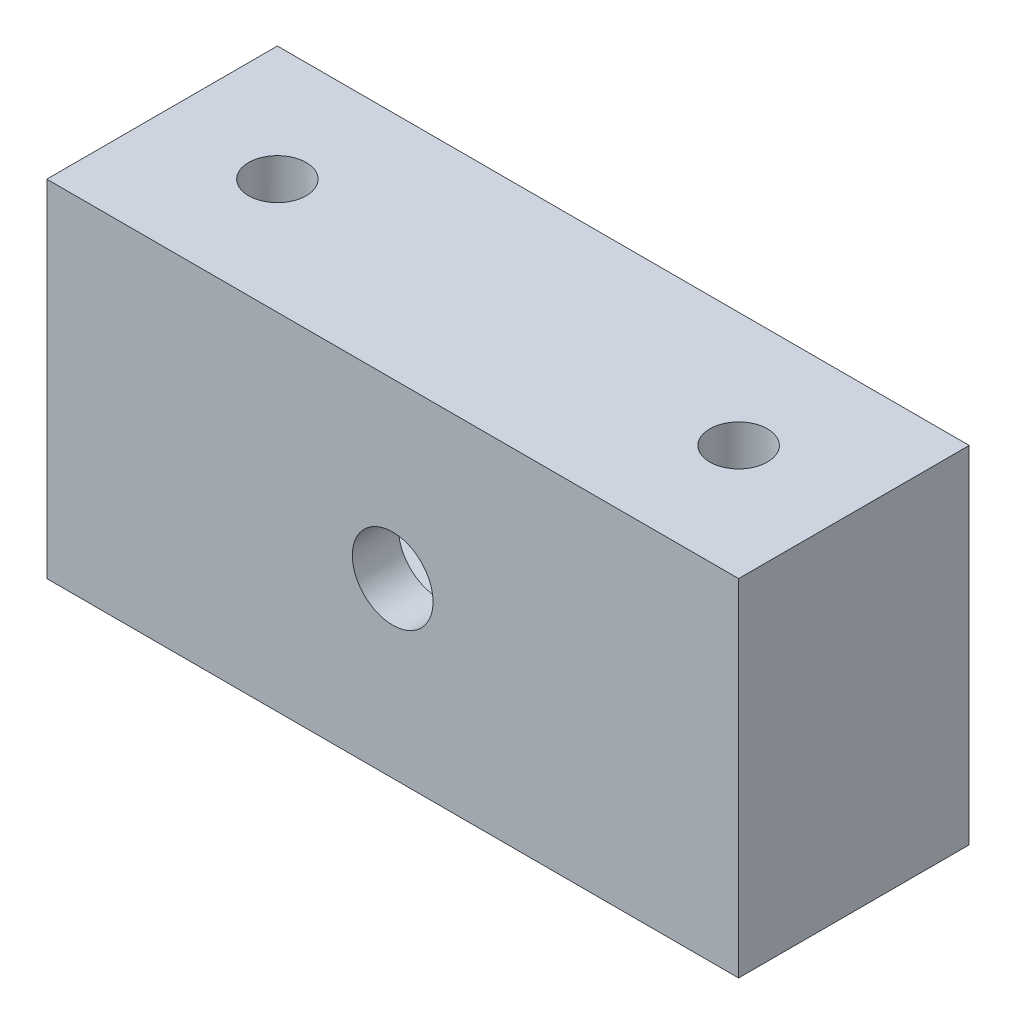
ISO-10303-21;
HEADER;
FILE_DESCRIPTION(('STEP AP214'),'2;1');
FILE_NAME('part.step','',(''),(''),'','','');
FILE_SCHEMA(('AUTOMOTIVE_DESIGN { 1 0 10303 214 1 1 1 1 }'));
ENDSEC;
DATA;
#1=APPLICATION_CONTEXT('core data for automotive mechanical design processes');
#2=APPLICATION_PROTOCOL_DEFINITION('international standard','automotive_design',2000,#1);
#3=PRODUCT_CONTEXT('',#1,'mechanical');
#4=PRODUCT('Part','Part','',(#3));
#5=PRODUCT_RELATED_PRODUCT_CATEGORY('part','',(#4));
#6=PRODUCT_DEFINITION_FORMATION('','',#4);
#7=PRODUCT_DEFINITION_CONTEXT('part definition',#1,'design');
#8=PRODUCT_DEFINITION('design','',#6,#7);
#9=PRODUCT_DEFINITION_SHAPE('','',#8);
#10=(LENGTH_UNIT() NAMED_UNIT(*) SI_UNIT(.MILLI.,.METRE.));
#11=(NAMED_UNIT(*) PLANE_ANGLE_UNIT() SI_UNIT($,.RADIAN.));
#12=(NAMED_UNIT(*) SI_UNIT($,.STERADIAN.) SOLID_ANGLE_UNIT());
#13=UNCERTAINTY_MEASURE_WITH_UNIT(LENGTH_MEASURE(1.E-05),#10,'distance_accuracy_value','');
#14=(GEOMETRIC_REPRESENTATION_CONTEXT(3) GLOBAL_UNCERTAINTY_ASSIGNED_CONTEXT((#13)) GLOBAL_UNIT_ASSIGNED_CONTEXT((#10,
#11,#12)) REPRESENTATION_CONTEXT('',''));
#15=CARTESIAN_POINT('',(0.,0.,0.));
#16=DIRECTION('',(0.,0.,1.));
#17=DIRECTION('',(1.,0.,0.));
#18=AXIS2_PLACEMENT_3D('',#15,#16,#17);
#19=CARTESIAN_POINT('',(15.,7.5,10.));
#20=DIRECTION('',(-1.,0.,0.));
#21=DIRECTION('',(0.,-1.,0.));
#22=AXIS2_PLACEMENT_3D('',#19,#20,#21);
#23=PLANE('',#22);
#24=DIRECTION('',(0.,1.,0.));
#25=VECTOR('',#24,1.);
#26=CARTESIAN_POINT('',(15.,7.5,0.));
#27=LINE('',#26,#25);
#28=CARTESIAN_POINT('',(15.,-7.5,0.));
#29=VERTEX_POINT('',#28);
#30=CARTESIAN_POINT('',(15.,7.5,0.));
#31=VERTEX_POINT('',#30);
#32=EDGE_CURVE('E254',#29,#31,#27,.T.);
#33=ORIENTED_EDGE('',*,*,#32,.T.);
#34=DIRECTION('',(0.,0.,-1.));
#35=VECTOR('',#34,1.);
#36=CARTESIAN_POINT('',(15.,7.5,10.));
#37=LINE('',#36,#35);
#38=CARTESIAN_POINT('',(15.,7.5,10.));
#39=VERTEX_POINT('',#38);
#40=EDGE_CURVE('E290',#39,#31,#37,.T.);
#41=ORIENTED_EDGE('',*,*,#40,.F.);
#42=DIRECTION('',(0.,1.,0.));
#43=VECTOR('',#42,1.);
#44=CARTESIAN_POINT('',(15.,7.5,10.));
#45=LINE('',#44,#43);
#46=CARTESIAN_POINT('',(15.,-7.5,10.));
#47=VERTEX_POINT('',#46);
#48=EDGE_CURVE('E264',#47,#39,#45,.T.);
#49=ORIENTED_EDGE('',*,*,#48,.F.);
#50=DIRECTION('',(0.,0.,-1.));
#51=VECTOR('',#50,1.);
#52=CARTESIAN_POINT('',(15.,-7.5,10.));
#53=LINE('',#52,#51);
#54=EDGE_CURVE('E274',#47,#29,#53,.T.);
#55=ORIENTED_EDGE('',*,*,#54,.T.);
#56=EDGE_LOOP('',(#33,#41,#49,#55));
#57=FACE_BOUND('',#56,.T.);
#58=ADVANCED_FACE('F35',(#57),#23,.F.);
#59=CARTESIAN_POINT('',(-15.,7.5,10.));
#60=DIRECTION('',(0.,-1.,0.));
#61=DIRECTION('',(0.,0.,-1.));
#62=AXIS2_PLACEMENT_3D('',#59,#60,#61);
#63=PLANE('',#62);
#64=CARTESIAN_POINT('',(-10.,7.5,5.));
#65=DIRECTION('',(0.,-1.,0.));
#66=DIRECTION('',(0.,0.,-1.));
#67=AXIS2_PLACEMENT_3D('',#64,#65,#66);
#68=CIRCLE('',#67,1.25);
#69=CARTESIAN_POINT('',(-10.,7.5,3.75));
#70=VERTEX_POINT('',#69);
#71=EDGE_CURVE('E163',#70,#70,#68,.T.);
#72=ORIENTED_EDGE('',*,*,#71,.T.);
#73=EDGE_LOOP('',(#72));
#74=FACE_BOUND('',#73,.T.);
#75=CARTESIAN_POINT('',(10.,7.5,5.));
#76=DIRECTION('',(0.,-1.,0.));
#77=DIRECTION('',(0.,0.,-1.));
#78=AXIS2_PLACEMENT_3D('',#75,#76,#77);
#79=CIRCLE('',#78,1.25);
#80=CARTESIAN_POINT('',(10.,7.5,3.75));
#81=VERTEX_POINT('',#80);
#82=EDGE_CURVE('E533',#81,#81,#79,.T.);
#83=ORIENTED_EDGE('',*,*,#82,.T.);
#84=EDGE_LOOP('',(#83));
#85=FACE_BOUND('',#84,.T.);
#86=DIRECTION('',(-1.,0.,0.));
#87=VECTOR('',#86,1.);
#88=CARTESIAN_POINT('',(-15.,7.5,0.));
#89=LINE('',#88,#87);
#90=CARTESIAN_POINT('',(-15.,7.5,0.));
#91=VERTEX_POINT('',#90);
#92=EDGE_CURVE('E277',#31,#91,#89,.T.);
#93=ORIENTED_EDGE('',*,*,#92,.T.);
#94=DIRECTION('',(0.,0.,-1.));
#95=VECTOR('',#94,1.);
#96=CARTESIAN_POINT('',(-15.,7.5,10.));
#97=LINE('',#96,#95);
#98=CARTESIAN_POINT('',(-15.,7.5,10.));
#99=VERTEX_POINT('',#98);
#100=EDGE_CURVE('E287',#99,#91,#97,.T.);
#101=ORIENTED_EDGE('',*,*,#100,.F.);
#102=DIRECTION('',(-1.,0.,0.));
#103=VECTOR('',#102,1.);
#104=CARTESIAN_POINT('',(-15.,7.5,10.));
#105=LINE('',#104,#103);
#106=EDGE_CURVE('E267',#39,#99,#105,.T.);
#107=ORIENTED_EDGE('',*,*,#106,.F.);
#108=ORIENTED_EDGE('',*,*,#40,.T.);
#109=EDGE_LOOP('',(#93,#101,#107,#108));
#110=FACE_BOUND('',#109,.T.);
#111=ADVANCED_FACE('F347',(#74,#85,#110),#63,.F.);
#112=CARTESIAN_POINT('',(-15.,7.5,10.));
#113=DIRECTION('',(1.,0.,0.));
#114=DIRECTION('',(0.,1.,0.));
#115=AXIS2_PLACEMENT_3D('',#112,#113,#114);
#116=PLANE('',#115);
#117=DIRECTION('',(0.,-1.,0.));
#118=VECTOR('',#117,1.);
#119=CARTESIAN_POINT('',(-15.,7.5,0.));
#120=LINE('',#119,#118);
#121=CARTESIAN_POINT('',(-15.,-7.5,0.));
#122=VERTEX_POINT('',#121);
#123=EDGE_CURVE('E279',#91,#122,#120,.T.);
#124=ORIENTED_EDGE('',*,*,#123,.T.);
#125=DIRECTION('',(0.,0.,-1.));
#126=VECTOR('',#125,1.);
#127=CARTESIAN_POINT('',(-15.,-7.5,10.));
#128=LINE('',#127,#126);
#129=CARTESIAN_POINT('',(-15.,-7.5,10.));
#130=VERTEX_POINT('',#129);
#131=EDGE_CURVE('E284',#130,#122,#128,.T.);
#132=ORIENTED_EDGE('',*,*,#131,.F.);
#133=DIRECTION('',(0.,-1.,0.));
#134=VECTOR('',#133,1.);
#135=CARTESIAN_POINT('',(-15.,7.5,10.));
#136=LINE('',#135,#134);
#137=EDGE_CURVE('E270',#99,#130,#136,.T.);
#138=ORIENTED_EDGE('',*,*,#137,.F.);
#139=ORIENTED_EDGE('',*,*,#100,.T.);
#140=EDGE_LOOP('',(#124,#132,#138,#139));
#141=FACE_BOUND('',#140,.T.);
#142=ADVANCED_FACE('F353',(#141),#116,.F.);
#143=CARTESIAN_POINT('',(-15.,-7.5,10.));
#144=DIRECTION('',(0.,1.,0.));
#145=DIRECTION('',(0.,0.,1.));
#146=AXIS2_PLACEMENT_3D('',#143,#144,#145);
#147=PLANE('',#146);
#148=CARTESIAN_POINT('',(-10.,-7.5,5.));
#149=DIRECTION('',(0.,-1.,0.));
#150=DIRECTION('',(0.,0.,-1.));
#151=AXIS2_PLACEMENT_3D('',#148,#149,#150);
#152=CIRCLE('',#151,1.25);
#153=CARTESIAN_POINT('',(-10.,-7.5,3.75));
#154=VERTEX_POINT('',#153);
#155=EDGE_CURVE('E541',#154,#154,#152,.T.);
#156=ORIENTED_EDGE('',*,*,#155,.F.);
#157=EDGE_LOOP('',(#156));
#158=FACE_BOUND('',#157,.T.);
#159=CARTESIAN_POINT('',(10.,-7.5,5.));
#160=DIRECTION('',(0.,-1.,0.));
#161=DIRECTION('',(0.,0.,-1.));
#162=AXIS2_PLACEMENT_3D('',#159,#160,#161);
#163=CIRCLE('',#162,1.25);
#164=CARTESIAN_POINT('',(10.,-7.5,3.75));
#165=VERTEX_POINT('',#164);
#166=EDGE_CURVE('E333',#165,#165,#163,.T.);
#167=ORIENTED_EDGE('',*,*,#166,.F.);
#168=EDGE_LOOP('',(#167));
#169=FACE_BOUND('',#168,.T.);
#170=DIRECTION('',(1.,0.,0.));
#171=VECTOR('',#170,1.);
#172=CARTESIAN_POINT('',(-15.,-7.5,0.));
#173=LINE('',#172,#171);
#174=EDGE_CURVE('E268',#122,#29,#173,.T.);
#175=ORIENTED_EDGE('',*,*,#174,.T.);
#176=ORIENTED_EDGE('',*,*,#54,.F.);
#177=DIRECTION('',(1.,0.,0.));
#178=VECTOR('',#177,1.);
#179=CARTESIAN_POINT('',(-15.,-7.5,10.));
#180=LINE('',#179,#178);
#181=EDGE_CURVE('E272',#130,#47,#180,.T.);
#182=ORIENTED_EDGE('',*,*,#181,.F.);
#183=ORIENTED_EDGE('',*,*,#131,.T.);
#184=EDGE_LOOP('',(#175,#176,#182,#183));
#185=FACE_BOUND('',#184,.T.);
#186=ADVANCED_FACE('F378',(#158,#169,#185),#147,.F.);
#187=CARTESIAN_POINT('',(0.,0.,10.));
#188=DIRECTION('',(0.,0.,1.));
#189=DIRECTION('',(1.,0.,0.));
#190=AXIS2_PLACEMENT_3D('',#187,#188,#189);
#191=PLANE('',#190);
#192=CARTESIAN_POINT('',(0.,0.,10.));
#193=DIRECTION('',(0.,0.,-1.));
#194=DIRECTION('',(-1.,0.,0.));
#195=AXIS2_PLACEMENT_3D('',#192,#193,#194);
#196=CIRCLE('',#195,1.75);
#197=CARTESIAN_POINT('',(-1.75,0.,10.));
#198=VERTEX_POINT('',#197);
#199=EDGE_CURVE('E236',#198,#198,#196,.T.);
#200=ORIENTED_EDGE('',*,*,#199,.T.);
#201=EDGE_LOOP('',(#200));
#202=FACE_BOUND('',#201,.T.);
#203=ORIENTED_EDGE('',*,*,#48,.T.);
#204=ORIENTED_EDGE('',*,*,#106,.T.);
#205=ORIENTED_EDGE('',*,*,#137,.T.);
#206=ORIENTED_EDGE('',*,*,#181,.T.);
#207=EDGE_LOOP('',(#203,#204,#205,#206));
#208=FACE_BOUND('',#207,.T.);
#209=ADVANCED_FACE('F375',(#202,#208),#191,.T.);
#210=CARTESIAN_POINT('',(0.,0.,0.));
#211=DIRECTION('',(0.,0.,1.));
#212=DIRECTION('',(1.,0.,0.));
#213=AXIS2_PLACEMENT_3D('',#210,#211,#212);
#214=PLANE('',#213);
#215=DIRECTION('',(-1.,0.,0.));
#216=VECTOR('',#215,1.);
#217=CARTESIAN_POINT('',(12.,-4.5,0.));
#218=LINE('',#217,#216);
#219=CARTESIAN_POINT('',(10.,-4.5,0.));
#220=VERTEX_POINT('',#219);
#221=CARTESIAN_POINT('',(-10.,-4.5,0.));
#222=VERTEX_POINT('',#221);
#223=EDGE_CURVE('E257',#220,#222,#218,.T.);
#224=ORIENTED_EDGE('',*,*,#223,.F.);
#225=CARTESIAN_POINT('',(10.,-2.5,0.));
#226=DIRECTION('',(0.,0.,1.));
#227=DIRECTION('',(1.,0.,0.));
#228=AXIS2_PLACEMENT_3D('',#225,#226,#227);
#229=CIRCLE('',#228,2.);
#230=CARTESIAN_POINT('',(12.,-2.5,0.));
#231=VERTEX_POINT('',#230);
#232=EDGE_CURVE('E198',#220,#231,#229,.T.);
#233=ORIENTED_EDGE('',*,*,#232,.T.);
#234=DIRECTION('',(0.,-1.,0.));
#235=VECTOR('',#234,1.);
#236=CARTESIAN_POINT('',(12.,4.5,0.));
#237=LINE('',#236,#235);
#238=CARTESIAN_POINT('',(12.,2.5,0.));
#239=VERTEX_POINT('',#238);
#240=EDGE_CURVE('E239',#239,#231,#237,.T.);
#241=ORIENTED_EDGE('',*,*,#240,.F.);
#242=CARTESIAN_POINT('',(10.,2.5,0.));
#243=DIRECTION('',(0.,0.,1.));
#244=DIRECTION('',(1.,0.,0.));
#245=AXIS2_PLACEMENT_3D('',#242,#243,#244);
#246=CIRCLE('',#245,2.);
#247=CARTESIAN_POINT('',(10.,4.5,0.));
#248=VERTEX_POINT('',#247);
#249=EDGE_CURVE('E202',#239,#248,#246,.T.);
#250=ORIENTED_EDGE('',*,*,#249,.T.);
#251=DIRECTION('',(1.,0.,0.));
#252=VECTOR('',#251,1.);
#253=CARTESIAN_POINT('',(-12.,4.5,0.));
#254=LINE('',#253,#252);
#255=CARTESIAN_POINT('',(-10.,4.5,0.));
#256=VERTEX_POINT('',#255);
#257=EDGE_CURVE('E246',#256,#248,#254,.T.);
#258=ORIENTED_EDGE('',*,*,#257,.F.);
#259=CARTESIAN_POINT('',(-10.,2.5,0.));
#260=DIRECTION('',(0.,0.,1.));
#261=DIRECTION('',(1.,0.,0.));
#262=AXIS2_PLACEMENT_3D('',#259,#260,#261);
#263=CIRCLE('',#262,2.);
#264=CARTESIAN_POINT('',(-12.,2.5,0.));
#265=VERTEX_POINT('',#264);
#266=EDGE_CURVE('E200',#256,#265,#263,.T.);
#267=ORIENTED_EDGE('',*,*,#266,.T.);
#268=DIRECTION('',(0.,1.,0.));
#269=VECTOR('',#268,1.);
#270=CARTESIAN_POINT('',(-12.,-4.5,0.));
#271=LINE('',#270,#269);
#272=CARTESIAN_POINT('',(-12.,-2.5,0.));
#273=VERTEX_POINT('',#272);
#274=EDGE_CURVE('E259',#273,#265,#271,.T.);
#275=ORIENTED_EDGE('',*,*,#274,.F.);
#276=CARTESIAN_POINT('',(-10.,-2.5,0.));
#277=DIRECTION('',(0.,0.,1.));
#278=DIRECTION('',(1.,0.,0.));
#279=AXIS2_PLACEMENT_3D('',#276,#277,#278);
#280=CIRCLE('',#279,2.);
#281=EDGE_CURVE('E196',#273,#222,#280,.T.);
#282=ORIENTED_EDGE('',*,*,#281,.T.);
#283=EDGE_LOOP('',(#224,#233,#241,#250,#258,#267,#275,#282));
#284=FACE_BOUND('',#283,.T.);
#285=ORIENTED_EDGE('',*,*,#32,.F.);
#286=ORIENTED_EDGE('',*,*,#174,.F.);
#287=ORIENTED_EDGE('',*,*,#123,.F.);
#288=ORIENTED_EDGE('',*,*,#92,.F.);
#289=EDGE_LOOP('',(#285,#286,#287,#288));
#290=FACE_BOUND('',#289,.T.);
#291=ADVANCED_FACE('F308',(#284,#290),#214,.F.);
#292=CARTESIAN_POINT('',(12.,4.5,8.));
#293=DIRECTION('',(1.,0.,0.));
#294=DIRECTION('',(0.,1.,0.));
#295=AXIS2_PLACEMENT_3D('',#292,#293,#294);
#296=PLANE('',#295);
#297=ORIENTED_EDGE('',*,*,#240,.T.);
#298=DIRECTION('',(0.,0.,-1.));
#299=VECTOR('',#298,1.);
#300=CARTESIAN_POINT('',(12.,-2.5,8.));
#301=LINE('',#300,#299);
#302=CARTESIAN_POINT('',(12.,-2.5,8.));
#303=VERTEX_POINT('',#302);
#304=EDGE_CURVE('E186',#231,#303,#301,.F.);
#305=ORIENTED_EDGE('',*,*,#304,.T.);
#306=DIRECTION('',(0.,-1.,0.));
#307=VECTOR('',#306,1.);
#308=CARTESIAN_POINT('',(12.,4.5,8.));
#309=LINE('',#308,#307);
#310=CARTESIAN_POINT('',(12.,2.5,8.));
#311=VERTEX_POINT('',#310);
#312=EDGE_CURVE('E242',#311,#303,#309,.T.);
#313=ORIENTED_EDGE('',*,*,#312,.F.);
#314=DIRECTION('',(0.,0.,-1.));
#315=VECTOR('',#314,1.);
#316=CARTESIAN_POINT('',(12.,2.5,0.));
#317=LINE('',#316,#315);
#318=EDGE_CURVE('E183',#311,#239,#317,.T.);
#319=ORIENTED_EDGE('',*,*,#318,.T.);
#320=EDGE_LOOP('',(#297,#305,#313,#319));
#321=FACE_BOUND('',#320,.T.);
#322=ADVANCED_FACE('F331',(#321),#296,.F.);
#323=CARTESIAN_POINT('',(-12.,4.5,8.));
#324=DIRECTION('',(0.,1.,0.));
#325=DIRECTION('',(0.,0.,1.));
#326=AXIS2_PLACEMENT_3D('',#323,#324,#325);
#327=PLANE('',#326);
#328=DIRECTION('',(0.,0.,-1.));
#329=VECTOR('',#328,1.);
#330=CARTESIAN_POINT('',(-10.,4.5,0.));
#331=LINE('',#330,#329);
#332=CARTESIAN_POINT('',(-10.,4.5,8.));
#333=VERTEX_POINT('',#332);
#334=CARTESIAN_POINT('',(-10.,4.5,6.25));
#335=VERTEX_POINT('',#334);
#336=EDGE_CURVE('E193',#333,#335,#331,.T.);
#337=ORIENTED_EDGE('',*,*,#336,.T.);
#338=CARTESIAN_POINT('',(-10.,4.5,5.));
#339=DIRECTION('',(0.,1.,0.));
#340=DIRECTION('',(0.,0.,1.));
#341=AXIS2_PLACEMENT_3D('',#338,#339,#340);
#342=CIRCLE('',#341,1.25);
#343=CARTESIAN_POINT('',(-10.,4.5,3.75));
#344=VERTEX_POINT('',#343);
#345=EDGE_CURVE('E55',#335,#344,#342,.T.);
#346=ORIENTED_EDGE('',*,*,#345,.T.);
#347=EDGE_CURVE('E192',#344,#256,#331,.T.);
#348=ORIENTED_EDGE('',*,*,#347,.T.);
#349=ORIENTED_EDGE('',*,*,#257,.T.);
#350=DIRECTION('',(0.,0.,-1.));
#351=VECTOR('',#350,1.);
#352=CARTESIAN_POINT('',(10.,4.5,8.));
#353=LINE('',#352,#351);
#354=CARTESIAN_POINT('',(10.,4.5,3.75));
#355=VERTEX_POINT('',#354);
#356=EDGE_CURVE('E189',#248,#355,#353,.F.);
#357=ORIENTED_EDGE('',*,*,#356,.T.);
#358=CARTESIAN_POINT('',(10.,4.5,5.));
#359=DIRECTION('',(0.,1.,0.));
#360=DIRECTION('',(0.,0.,1.));
#361=AXIS2_PLACEMENT_3D('',#358,#359,#360);
#362=CIRCLE('',#361,1.25);
#363=CARTESIAN_POINT('',(10.,4.5,6.25));
#364=VERTEX_POINT('',#363);
#365=EDGE_CURVE('E230',#355,#364,#362,.T.);
#366=ORIENTED_EDGE('',*,*,#365,.T.);
#367=CARTESIAN_POINT('',(10.,4.5,8.));
#368=VERTEX_POINT('',#367);
#369=EDGE_CURVE('E188',#364,#368,#353,.F.);
#370=ORIENTED_EDGE('',*,*,#369,.T.);
#371=DIRECTION('',(1.,0.,0.));
#372=VECTOR('',#371,1.);
#373=CARTESIAN_POINT('',(-12.,4.5,8.));
#374=LINE('',#373,#372);
#375=EDGE_CURVE('E251',#333,#368,#374,.T.);
#376=ORIENTED_EDGE('',*,*,#375,.F.);
#377=EDGE_LOOP('',(#337,#346,#348,#349,#357,#366,#370,#376));
#378=FACE_BOUND('',#377,.T.);
#379=ADVANCED_FACE('F324',(#378),#327,.F.);
#380=CARTESIAN_POINT('',(-12.,-4.5,8.));
#381=DIRECTION('',(-1.,0.,0.));
#382=DIRECTION('',(0.,-1.,0.));
#383=AXIS2_PLACEMENT_3D('',#380,#381,#382);
#384=PLANE('',#383);
#385=DIRECTION('',(0.,1.,0.));
#386=VECTOR('',#385,1.);
#387=CARTESIAN_POINT('',(-12.,-4.5,8.));
#388=LINE('',#387,#386);
#389=CARTESIAN_POINT('',(-12.,-2.5,8.));
#390=VERTEX_POINT('',#389);
#391=CARTESIAN_POINT('',(-12.,2.5,8.));
#392=VERTEX_POINT('',#391);
#393=EDGE_CURVE('E248',#390,#392,#388,.T.);
#394=ORIENTED_EDGE('',*,*,#393,.F.);
#395=DIRECTION('',(0.,0.,-1.));
#396=VECTOR('',#395,1.);
#397=CARTESIAN_POINT('',(-12.,-2.5,0.));
#398=LINE('',#397,#396);
#399=EDGE_CURVE('E294',#390,#273,#398,.T.);
#400=ORIENTED_EDGE('',*,*,#399,.T.);
#401=ORIENTED_EDGE('',*,*,#274,.T.);
#402=DIRECTION('',(0.,0.,-1.));
#403=VECTOR('',#402,1.);
#404=CARTESIAN_POINT('',(-12.,2.5,8.));
#405=LINE('',#404,#403);
#406=EDGE_CURVE('E293',#265,#392,#405,.F.);
#407=ORIENTED_EDGE('',*,*,#406,.T.);
#408=EDGE_LOOP('',(#394,#400,#401,#407));
#409=FACE_BOUND('',#408,.T.);
#410=ADVANCED_FACE('F313',(#409),#384,.F.);
#411=CARTESIAN_POINT('',(12.,-4.5,8.));
#412=DIRECTION('',(0.,-1.,0.));
#413=DIRECTION('',(0.,0.,-1.));
#414=AXIS2_PLACEMENT_3D('',#411,#412,#413);
#415=PLANE('',#414);
#416=DIRECTION('',(0.,0.,-1.));
#417=VECTOR('',#416,1.);
#418=CARTESIAN_POINT('',(-10.,-4.5,8.));
#419=LINE('',#418,#417);
#420=CARTESIAN_POINT('',(-10.,-4.5,3.75));
#421=VERTEX_POINT('',#420);
#422=EDGE_CURVE('E161',#222,#421,#419,.F.);
#423=ORIENTED_EDGE('',*,*,#422,.T.);
#424=CARTESIAN_POINT('',(-10.,-4.5,5.));
#425=DIRECTION('',(0.,-1.,0.));
#426=DIRECTION('',(0.,0.,-1.));
#427=AXIS2_PLACEMENT_3D('',#424,#425,#426);
#428=CIRCLE('',#427,1.25);
#429=CARTESIAN_POINT('',(-10.,-4.5,6.25));
#430=VERTEX_POINT('',#429);
#431=EDGE_CURVE('E62',#421,#430,#428,.T.);
#432=ORIENTED_EDGE('',*,*,#431,.T.);
#433=CARTESIAN_POINT('',(-10.,-4.5,8.));
#434=VERTEX_POINT('',#433);
#435=EDGE_CURVE('E158',#430,#434,#419,.F.);
#436=ORIENTED_EDGE('',*,*,#435,.T.);
#437=DIRECTION('',(-1.,0.,0.));
#438=VECTOR('',#437,1.);
#439=CARTESIAN_POINT('',(12.,-4.5,8.));
#440=LINE('',#439,#438);
#441=CARTESIAN_POINT('',(10.,-4.5,8.));
#442=VERTEX_POINT('',#441);
#443=EDGE_CURVE('E245',#442,#434,#440,.T.);
#444=ORIENTED_EDGE('',*,*,#443,.F.);
#445=DIRECTION('',(0.,0.,-1.));
#446=VECTOR('',#445,1.);
#447=CARTESIAN_POINT('',(10.,-4.5,0.));
#448=LINE('',#447,#446);
#449=CARTESIAN_POINT('',(10.,-4.5,6.25));
#450=VERTEX_POINT('',#449);
#451=EDGE_CURVE('E169',#442,#450,#448,.T.);
#452=ORIENTED_EDGE('',*,*,#451,.T.);
#453=CARTESIAN_POINT('',(10.,-4.5,5.));
#454=DIRECTION('',(0.,-1.,0.));
#455=DIRECTION('',(0.,0.,-1.));
#456=AXIS2_PLACEMENT_3D('',#453,#454,#455);
#457=CIRCLE('',#456,1.25);
#458=CARTESIAN_POINT('',(10.,-4.5,3.75));
#459=VERTEX_POINT('',#458);
#460=EDGE_CURVE('E231',#450,#459,#457,.T.);
#461=ORIENTED_EDGE('',*,*,#460,.T.);
#462=EDGE_CURVE('E173',#459,#220,#448,.T.);
#463=ORIENTED_EDGE('',*,*,#462,.T.);
#464=ORIENTED_EDGE('',*,*,#223,.T.);
#465=EDGE_LOOP('',(#423,#432,#436,#444,#452,#461,#463,#464));
#466=FACE_BOUND('',#465,.T.);
#467=ADVANCED_FACE('F156',(#466),#415,.F.);
#468=CARTESIAN_POINT('',(0.,0.,8.));
#469=DIRECTION('',(0.,0.,-1.));
#470=DIRECTION('',(-1.,0.,0.));
#471=AXIS2_PLACEMENT_3D('',#468,#469,#470);
#472=PLANE('',#471);
#473=CARTESIAN_POINT('',(0.,0.,8.));
#474=DIRECTION('',(0.,0.,-1.));
#475=DIRECTION('',(-1.,0.,0.));
#476=AXIS2_PLACEMENT_3D('',#473,#474,#475);
#477=CIRCLE('',#476,1.75);
#478=CARTESIAN_POINT('',(-1.75,0.,8.));
#479=VERTEX_POINT('',#478);
#480=EDGE_CURVE('E235',#479,#479,#477,.T.);
#481=ORIENTED_EDGE('',*,*,#480,.F.);
#482=EDGE_LOOP('',(#481));
#483=FACE_BOUND('',#482,.T.);
#484=ORIENTED_EDGE('',*,*,#443,.T.);
#485=CARTESIAN_POINT('',(-10.,-2.5,8.));
#486=DIRECTION('',(0.,0.,-1.));
#487=DIRECTION('',(-1.,0.,0.));
#488=AXIS2_PLACEMENT_3D('',#485,#486,#487);
#489=CIRCLE('',#488,2.);
#490=EDGE_CURVE('E168',#434,#390,#489,.T.);
#491=ORIENTED_EDGE('',*,*,#490,.T.);
#492=ORIENTED_EDGE('',*,*,#393,.T.);
#493=CARTESIAN_POINT('',(-10.,2.5,8.));
#494=DIRECTION('',(0.,0.,-1.));
#495=DIRECTION('',(-1.,0.,0.));
#496=AXIS2_PLACEMENT_3D('',#493,#494,#495);
#497=CIRCLE('',#496,2.);
#498=EDGE_CURVE('E178',#392,#333,#497,.T.);
#499=ORIENTED_EDGE('',*,*,#498,.T.);
#500=ORIENTED_EDGE('',*,*,#375,.T.);
#501=CARTESIAN_POINT('',(10.,2.5,8.));
#502=DIRECTION('',(0.,0.,-1.));
#503=DIRECTION('',(-1.,0.,0.));
#504=AXIS2_PLACEMENT_3D('',#501,#502,#503);
#505=CIRCLE('',#504,2.);
#506=EDGE_CURVE('E171',#368,#311,#505,.T.);
#507=ORIENTED_EDGE('',*,*,#506,.T.);
#508=ORIENTED_EDGE('',*,*,#312,.T.);
#509=CARTESIAN_POINT('',(10.,-2.5,8.));
#510=DIRECTION('',(0.,0.,-1.));
#511=DIRECTION('',(-1.,0.,0.));
#512=AXIS2_PLACEMENT_3D('',#509,#510,#511);
#513=CIRCLE('',#512,2.);
#514=EDGE_CURVE('E180',#303,#442,#513,.T.);
#515=ORIENTED_EDGE('',*,*,#514,.T.);
#516=EDGE_LOOP('',(#484,#491,#492,#499,#500,#507,#508,#515));
#517=FACE_BOUND('',#516,.T.);
#518=ADVANCED_FACE('F321',(#483,#517),#472,.T.);
#519=CARTESIAN_POINT('',(-10.,-2.5,8.));
#520=DIRECTION('',(0.,0.,1.));
#521=DIRECTION('',(1.,0.,0.));
#522=AXIS2_PLACEMENT_3D('',#519,#520,#521);
#523=CYLINDRICAL_SURFACE('',#522,2.);
#524=ORIENTED_EDGE('',*,*,#435,.F.);
#525=CARTESIAN_POINT('',(-10.,-4.5,6.25));
#526=CARTESIAN_POINT('',(-10.031922119046,-4.5000037585437,6.25000245376051));
#527=CARTESIAN_POINT('',(-10.0638265161901,-4.4992349396388,6.24877628678655));
#528=CARTESIAN_POINT('',(-10.1273610628371,-4.49619336183597,6.24390245511982));
#529=CARTESIAN_POINT('',(-10.1589913484681,-4.4939213986083,6.24025607153456));
#530=CARTESIAN_POINT('',(-10.2527484927996,-4.48495105118465,6.2258022366321));
#531=CARTESIAN_POINT('',(-10.314169763864,-4.47609705197088,6.21147899680838));
#532=CARTESIAN_POINT('',(-10.4331791135223,-4.45346648902098,6.1742011222019));
#533=CARTESIAN_POINT('',(-10.4907734718518,-4.43969823838252,6.15126106048576));
#534=CARTESIAN_POINT('',(-10.6011857898314,-4.40836945576292,6.09765534049891));
#535=CARTESIAN_POINT('',(-10.6539977898893,-4.39080428202583,6.06698021836851));
#536=CARTESIAN_POINT('',(-10.7579795037052,-4.35169998105219,5.99611056098801));
#537=CARTESIAN_POINT('',(-10.8086876837545,-4.32995627362263,5.95535441190823));
#538=CARTESIAN_POINT('',(-10.9029927735658,-4.28530997139988,5.86677347143408));
#539=CARTESIAN_POINT('',(-10.9465810731099,-4.26240601669069,5.81894025281724));
#540=CARTESIAN_POINT('',(-11.0314291637585,-4.21430399929838,5.7099656762796));
#541=CARTESIAN_POINT('',(-11.0715726872027,-4.18921573535936,5.64789928408816));
#542=CARTESIAN_POINT('',(-11.1407400713465,-4.14330166868869,5.51643414331901));
#543=CARTESIAN_POINT('',(-11.1697828736249,-4.12246863364673,5.44704814502036));
#544=CARTESIAN_POINT('',(-11.2093338993252,-4.09309583839399,5.32118982895372));
#545=CARTESIAN_POINT('',(-11.2226953492215,-4.08276919521741,5.26603390790265));
#546=CARTESIAN_POINT('',(-11.2418183583979,-4.06781363504852,5.15369482696655));
#547=CARTESIAN_POINT('',(-11.2475905515611,-4.06317674631938,5.09651461915647));
#548=CARTESIAN_POINT('',(-11.2511891872087,-4.06029885393018,4.98158683283478));
#549=CARTESIAN_POINT('',(-11.248994824432,-4.06207459727786,4.92383816207547));
#550=CARTESIAN_POINT('',(-11.2367631194447,-4.07177406494754,4.80968960258133));
#551=CARTESIAN_POINT('',(-11.2267195318356,-4.07970268489812,4.75329082476165));
#552=CARTESIAN_POINT('',(-11.1996810990638,-4.10032567773565,4.64456182897269));
#553=CARTESIAN_POINT('',(-11.1828503264835,-4.11290701874131,4.59216809301828));
#554=CARTESIAN_POINT('',(-11.1429021585306,-4.14145549710424,4.49083933264623));
#555=CARTESIAN_POINT('',(-11.1197824739419,-4.15742386690098,4.44190557587782));
#556=CARTESIAN_POINT('',(-11.0629477303814,-4.19454889121023,4.33916469420412));
#557=CARTESIAN_POINT('',(-11.0280601138274,-4.21611747919003,4.28615531611535));
#558=CARTESIAN_POINT('',(-10.9508786934146,-4.26005875464385,4.18616631223613));
#559=CARTESIAN_POINT('',(-10.9085778110655,-4.28243219424883,4.13919252444867));
#560=CARTESIAN_POINT('',(-10.809530530225,-4.32979309726449,4.0447098156314));
#561=CARTESIAN_POINT('',(-10.7515523783221,-4.35460386436419,3.99838798495382));
#562=CARTESIAN_POINT('',(-10.6271841045469,-4.40027106334996,3.91616584917251));
#563=CARTESIAN_POINT('',(-10.5607934534622,-4.42112724625536,3.88026620017397));
#564=CARTESIAN_POINT('',(-10.4247893553751,-4.45555226042475,3.82220353517582));
#565=CARTESIAN_POINT('',(-10.3555355983052,-4.46944991614083,3.79941101138647));
#566=CARTESIAN_POINT('',(-10.2488995359328,-4.48477920223599,3.7744850940894));
#567=CARTESIAN_POINT('',(-10.212933235217,-4.48896795316175,3.76772247134501));
#568=CARTESIAN_POINT('',(-10.1403812799852,-4.49539760019133,3.75736967984734));
#569=CARTESIAN_POINT('',(-10.1037960330852,-4.49763973097923,3.753777500151));
#570=CARTESIAN_POINT('',(-10.0447582583586,-4.49962559269496,3.75059967480121));
#571=CARTESIAN_POINT('',(-10.0223764272068,-4.50000359356028,3.74999636943947));
#572=CARTESIAN_POINT('',(-10.,-4.5,3.75));
#573=B_SPLINE_CURVE_WITH_KNOTS('',3,(#525,#526,#527,#528,#529,#530,#531,#532,#533,#534,#535,
#536,#537,#538,#539,#540,#541,#542,#543,#544,#545,#546,#547,#548,#549,#550,#551,#552,#553,#554,
#555,#556,#557,#558,#559,#560,#561,#562,#563,#564,#565,#566,#567,#568,#569,#570,#571,#572),
.UNSPECIFIED.,.F.,.F.,(4,2,2,2,2,2,2,2,2,2,2,2,2,2,2,2,2,2,2,2,2,2,2,4),(0.,0.0956995879951362,
0.191348559121157,0.381380485573127,0.571092460026872,0.761037683288744,0.966030249380817,
1.17126891066998,1.40432412527576,1.63697987453873,1.80931158747957,1.98140157514463,
2.1539413116935,2.3266184730063,2.49535013911643,2.66414330733162,2.86447441180867,
3.06499785333632,3.29856108222106,3.53213901137089,3.75328297336686,3.86362886182897,
3.97390470989089,4.04103681241263),.UNSPECIFIED.);
#574=EDGE_CURVE('E11',#430,#421,#573,.T.);
#575=ORIENTED_EDGE('',*,*,#574,.T.);
#576=ORIENTED_EDGE('',*,*,#422,.F.);
#577=ORIENTED_EDGE('',*,*,#281,.F.);
#578=ORIENTED_EDGE('',*,*,#399,.F.);
#579=ORIENTED_EDGE('',*,*,#490,.F.);
#580=EDGE_LOOP('',(#524,#575,#576,#577,#578,#579));
#581=FACE_BOUND('',#580,.T.);
#582=ADVANCED_FACE('F166',(#581),#523,.F.);
#583=CARTESIAN_POINT('',(10.,-2.5,8.));
#584=DIRECTION('',(0.,0.,1.));
#585=DIRECTION('',(1.,0.,0.));
#586=AXIS2_PLACEMENT_3D('',#583,#584,#585);
#587=CYLINDRICAL_SURFACE('',#586,2.);
#588=ORIENTED_EDGE('',*,*,#462,.F.);
#589=CARTESIAN_POINT('',(10.,-4.5,3.75));
#590=CARTESIAN_POINT('',(10.031922119046,-4.5000037585437,3.74999754623948));
#591=CARTESIAN_POINT('',(10.0638265161901,-4.4992349396388,3.75122371321345));
#592=CARTESIAN_POINT('',(10.1273610628371,-4.49619336183597,3.75609754488018));
#593=CARTESIAN_POINT('',(10.1589913484681,-4.4939213986083,3.75974392846544));
#594=CARTESIAN_POINT('',(10.2527484927996,-4.48495105118465,3.7741977633679));
#595=CARTESIAN_POINT('',(10.314169763864,-4.47609705197088,3.78852100319162));
#596=CARTESIAN_POINT('',(10.4331791135223,-4.45346648902098,3.8257988777981));
#597=CARTESIAN_POINT('',(10.4907734718518,-4.43969823838252,3.84873893951424));
#598=CARTESIAN_POINT('',(10.6011857898314,-4.40836945576292,3.90234465950108));
#599=CARTESIAN_POINT('',(10.6539977898893,-4.39080428202583,3.93301978163149));
#600=CARTESIAN_POINT('',(10.7579795037052,-4.35169998105219,4.00388943901199));
#601=CARTESIAN_POINT('',(10.8086876837545,-4.32995627362263,4.04464558809177));
#602=CARTESIAN_POINT('',(10.9029927735658,-4.28530997139988,4.13322652856592));
#603=CARTESIAN_POINT('',(10.9465810731099,-4.26240601669069,4.18105974718276));
#604=CARTESIAN_POINT('',(11.0314291637585,-4.21430399929838,4.29003432372041));
#605=CARTESIAN_POINT('',(11.0715726872027,-4.18921573535936,4.35210071591185));
#606=CARTESIAN_POINT('',(11.1407400713465,-4.14330166868869,4.483565856681));
#607=CARTESIAN_POINT('',(11.1697828736249,-4.12246863364673,4.55295185497964));
#608=CARTESIAN_POINT('',(11.2093338993252,-4.09309583839399,4.67881017104629));
#609=CARTESIAN_POINT('',(11.2226953492215,-4.08276919521741,4.73396609209735));
#610=CARTESIAN_POINT('',(11.2418183583979,-4.06781363504852,4.84630517303346));
#611=CARTESIAN_POINT('',(11.2475905515611,-4.06317674631938,4.90348538084354));
#612=CARTESIAN_POINT('',(11.2511891872087,-4.06029885393018,5.01841316716522));
#613=CARTESIAN_POINT('',(11.248994824432,-4.06207459727787,5.07616183792453));
#614=CARTESIAN_POINT('',(11.2367631194447,-4.07177406494754,5.19031039741868));
#615=CARTESIAN_POINT('',(11.2267195318356,-4.07970268489812,5.24670917523835));
#616=CARTESIAN_POINT('',(11.1996810990638,-4.10032567773565,5.35543817102731));
#617=CARTESIAN_POINT('',(11.1828503264835,-4.11290701874131,5.40783190698173));
#618=CARTESIAN_POINT('',(11.1429021585306,-4.14145549710425,5.50916066735377));
#619=CARTESIAN_POINT('',(11.1197824739419,-4.15742386690098,5.55809442412219));
#620=CARTESIAN_POINT('',(11.0629477303814,-4.19454889121023,5.66083530579589));
#621=CARTESIAN_POINT('',(11.0280601138274,-4.21611747919003,5.71384468388465));
#622=CARTESIAN_POINT('',(10.9508786934146,-4.26005875464385,5.81383368776388));
#623=CARTESIAN_POINT('',(10.9085778110655,-4.28243219424883,5.86080747555133));
#624=CARTESIAN_POINT('',(10.809530530225,-4.3297930972645,5.95529018436861));
#625=CARTESIAN_POINT('',(10.7515523783221,-4.35460386436419,6.00161201504618));
#626=CARTESIAN_POINT('',(10.6271841045469,-4.40027106334997,6.08383415082749));
#627=CARTESIAN_POINT('',(10.5607934534622,-4.42112724625536,6.11973379982603));
#628=CARTESIAN_POINT('',(10.4247893553751,-4.45555226042475,6.17779646482419));
#629=CARTESIAN_POINT('',(10.3555355983052,-4.46944991614083,6.20058898861353));
#630=CARTESIAN_POINT('',(10.2488995359328,-4.48477920223599,6.2255149059106));
#631=CARTESIAN_POINT('',(10.212933235217,-4.48896795316175,6.232277528655));
#632=CARTESIAN_POINT('',(10.1403812799852,-4.49539760019133,6.24263032015266));
#633=CARTESIAN_POINT('',(10.1037960330852,-4.49763973097923,6.246222499849));
#634=CARTESIAN_POINT('',(10.0447582583586,-4.49962559269496,6.24940032519879));
#635=CARTESIAN_POINT('',(10.0223764272068,-4.50000359356028,6.25000363056053));
#636=CARTESIAN_POINT('',(10.,-4.5,6.25));
#637=B_SPLINE_CURVE_WITH_KNOTS('',3,(#589,#590,#591,#592,#593,#594,#595,#596,#597,#598,#599,
#600,#601,#602,#603,#604,#605,#606,#607,#608,#609,#610,#611,#612,#613,#614,#615,#616,#617,#618,
#619,#620,#621,#622,#623,#624,#625,#626,#627,#628,#629,#630,#631,#632,#633,#634,#635,#636),
.UNSPECIFIED.,.F.,.F.,(4,2,2,2,2,2,2,2,2,2,2,2,2,2,2,2,2,2,2,2,2,2,2,4),(0.,0.0956995879951362,
0.191348559121158,0.381380485573129,0.571092460026873,0.761037683288745,0.96603024938082,
1.17126891066998,1.40432412527576,1.63697987453874,1.80931158747957,1.98140157514464,
2.1539413116935,2.32661847300631,2.49535013911643,2.66414330733162,2.86447441180867,
3.06499785333632,3.29856108222106,3.53213901137089,3.75328297336687,3.86362886182897,
3.9739047098909,4.04103681241263),.UNSPECIFIED.);
#638=EDGE_CURVE('E49',#459,#450,#637,.T.);
#639=ORIENTED_EDGE('',*,*,#638,.T.);
#640=ORIENTED_EDGE('',*,*,#451,.F.);
#641=ORIENTED_EDGE('',*,*,#514,.F.);
#642=ORIENTED_EDGE('',*,*,#304,.F.);
#643=ORIENTED_EDGE('',*,*,#232,.F.);
#644=EDGE_LOOP('',(#588,#639,#640,#641,#642,#643));
#645=FACE_BOUND('',#644,.T.);
#646=ADVANCED_FACE('F209',(#645),#587,.F.);
#647=CARTESIAN_POINT('',(-10.,2.5,8.));
#648=DIRECTION('',(0.,0.,1.));
#649=DIRECTION('',(1.,0.,0.));
#650=AXIS2_PLACEMENT_3D('',#647,#648,#649);
#651=CYLINDRICAL_SURFACE('',#650,2.);
#652=ORIENTED_EDGE('',*,*,#347,.F.);
#653=CARTESIAN_POINT('',(-10.,4.5,3.75));
#654=CARTESIAN_POINT('',(-10.031922119046,4.50000375854369,3.74999754623949));
#655=CARTESIAN_POINT('',(-10.0638265161901,4.4992349396388,3.75122371321345));
#656=CARTESIAN_POINT('',(-10.1273610628371,4.49619336183597,3.75609754488018));
#657=CARTESIAN_POINT('',(-10.1589913484681,4.4939213986083,3.75974392846544));
#658=CARTESIAN_POINT('',(-10.2527484927996,4.48495105118465,3.7741977633679));
#659=CARTESIAN_POINT('',(-10.314169763864,4.47609705197087,3.78852100319162));
#660=CARTESIAN_POINT('',(-10.4331791135223,4.45346648902098,3.8257988777981));
#661=CARTESIAN_POINT('',(-10.4907734718518,4.43969823838251,3.84873893951424));
#662=CARTESIAN_POINT('',(-10.6011857898314,4.40836945576292,3.90234465950109));
#663=CARTESIAN_POINT('',(-10.6539977898893,4.39080428202582,3.93301978163149));
#664=CARTESIAN_POINT('',(-10.7579795037052,4.35169998105219,4.00388943901199));
#665=CARTESIAN_POINT('',(-10.8086876837545,4.32995627362263,4.04464558809177));
#666=CARTESIAN_POINT('',(-10.9029927735658,4.28530997139988,4.13322652856592));
#667=CARTESIAN_POINT('',(-10.9465810731099,4.26240601669069,4.18105974718276));
#668=CARTESIAN_POINT('',(-11.0314291637585,4.21430399929837,4.2900343237204));
#669=CARTESIAN_POINT('',(-11.0715726872027,4.18921573535936,4.35210071591184));
#670=CARTESIAN_POINT('',(-11.1407400713465,4.14330166868868,4.48356585668099));
#671=CARTESIAN_POINT('',(-11.1697828736249,4.12246863364673,4.55295185497964));
#672=CARTESIAN_POINT('',(-11.2093338993252,4.09309583839399,4.67881017104629));
#673=CARTESIAN_POINT('',(-11.2226953492215,4.08276919521741,4.73396609209735));
#674=CARTESIAN_POINT('',(-11.2418183583979,4.06781363504852,4.84630517303345));
#675=CARTESIAN_POINT('',(-11.2475905515611,4.06317674631938,4.90348538084353));
#676=CARTESIAN_POINT('',(-11.2511891872087,4.06029885393017,5.01841316716522));
#677=CARTESIAN_POINT('',(-11.248994824432,4.06207459727786,5.07616183792453));
#678=CARTESIAN_POINT('',(-11.2367631194447,4.07177406494754,5.19031039741867));
#679=CARTESIAN_POINT('',(-11.2267195318356,4.07970268489812,5.24670917523835));
#680=CARTESIAN_POINT('',(-11.1996810990638,4.10032567773565,5.35543817102731));
#681=CARTESIAN_POINT('',(-11.1828503264834,4.11290701874131,5.40783190698172));
#682=CARTESIAN_POINT('',(-11.1429021585306,4.14145549710424,5.50916066735377));
#683=CARTESIAN_POINT('',(-11.1197824739419,4.15742386690098,5.55809442412218));
#684=CARTESIAN_POINT('',(-11.0629477303814,4.19454889121023,5.66083530579588));
#685=CARTESIAN_POINT('',(-11.0280601138274,4.21611747919003,5.71384468388465));
#686=CARTESIAN_POINT('',(-10.9508786934146,4.26005875464384,5.81383368776387));
#687=CARTESIAN_POINT('',(-10.9085778110655,4.28243219424882,5.86080747555133));
#688=CARTESIAN_POINT('',(-10.809530530225,4.32979309726449,5.95529018436861));
#689=CARTESIAN_POINT('',(-10.7515523783221,4.35460386436419,6.00161201504618));
#690=CARTESIAN_POINT('',(-10.6271841045469,4.40027106334996,6.08383415082749));
#691=CARTESIAN_POINT('',(-10.5607934534622,4.42112724625536,6.11973379982603));
#692=CARTESIAN_POINT('',(-10.4247893553751,4.45555226042475,6.17779646482418));
#693=CARTESIAN_POINT('',(-10.3555355983052,4.46944991614082,6.20058898861353));
#694=CARTESIAN_POINT('',(-10.2488995359328,4.48477920223598,6.2255149059106));
#695=CARTESIAN_POINT('',(-10.212933235217,4.48896795316175,6.232277528655));
#696=CARTESIAN_POINT('',(-10.1403812799852,4.49539760019133,6.24263032015266));
#697=CARTESIAN_POINT('',(-10.1037960330852,4.49763973097923,6.246222499849));
#698=CARTESIAN_POINT('',(-10.0447582583586,4.49962559269496,6.24940032519879));
#699=CARTESIAN_POINT('',(-10.0223764272068,4.50000359356028,6.25000363056053));
#700=CARTESIAN_POINT('',(-10.,4.5,6.25));
#701=B_SPLINE_CURVE_WITH_KNOTS('',3,(#653,#654,#655,#656,#657,#658,#659,#660,#661,#662,#663,
#664,#665,#666,#667,#668,#669,#670,#671,#672,#673,#674,#675,#676,#677,#678,#679,#680,#681,#682,
#683,#684,#685,#686,#687,#688,#689,#690,#691,#692,#693,#694,#695,#696,#697,#698,#699,#700),
.UNSPECIFIED.,.F.,.F.,(4,2,2,2,2,2,2,2,2,2,2,2,2,2,2,2,2,2,2,2,2,2,2,4),(0.,0.0956995879951379,
0.191348559121156,0.381380485573127,0.571092460026873,0.761037683288745,0.966030249380817,
1.17126891066998,1.40432412527576,1.63697987453873,1.80931158747957,1.98140157514463,
2.1539413116935,2.3266184730063,2.49535013911642,2.66414330733162,2.86447441180866,
3.06499785333632,3.29856108222106,3.53213901137089,3.75328297336687,3.86362886182897,
3.97390470989089,4.04103681241263),.UNSPECIFIED.);
#702=EDGE_CURVE('E162',#344,#335,#701,.T.);
#703=ORIENTED_EDGE('',*,*,#702,.T.);
#704=ORIENTED_EDGE('',*,*,#336,.F.);
#705=ORIENTED_EDGE('',*,*,#498,.F.);
#706=ORIENTED_EDGE('',*,*,#406,.F.);
#707=ORIENTED_EDGE('',*,*,#266,.F.);
#708=EDGE_LOOP('',(#652,#703,#704,#705,#706,#707));
#709=FACE_BOUND('',#708,.T.);
#710=ADVANCED_FACE('F317',(#709),#651,.F.);
#711=CARTESIAN_POINT('',(10.,2.5,8.));
#712=DIRECTION('',(0.,0.,1.));
#713=DIRECTION('',(1.,0.,0.));
#714=AXIS2_PLACEMENT_3D('',#711,#712,#713);
#715=CYLINDRICAL_SURFACE('',#714,2.);
#716=ORIENTED_EDGE('',*,*,#369,.F.);
#717=CARTESIAN_POINT('',(10.,4.5,6.25));
#718=CARTESIAN_POINT('',(10.031922119046,4.50000375854369,6.25000245376052));
#719=CARTESIAN_POINT('',(10.0638265161901,4.4992349396388,6.24877628678655));
#720=CARTESIAN_POINT('',(10.1273610628371,4.49619336183597,6.24390245511982));
#721=CARTESIAN_POINT('',(10.1589913484681,4.4939213986083,6.24025607153456));
#722=CARTESIAN_POINT('',(10.2527484927996,4.48495105118465,6.2258022366321));
#723=CARTESIAN_POINT('',(10.314169763864,4.47609705197087,6.21147899680838));
#724=CARTESIAN_POINT('',(10.4331791135223,4.45346648902098,6.1742011222019));
#725=CARTESIAN_POINT('',(10.4907734718518,4.43969823838251,6.15126106048576));
#726=CARTESIAN_POINT('',(10.6011857898314,4.40836945576292,6.09765534049891));
#727=CARTESIAN_POINT('',(10.6539977898893,4.39080428202582,6.06698021836851));
#728=CARTESIAN_POINT('',(10.7579795037052,4.35169998105219,5.99611056098801));
#729=CARTESIAN_POINT('',(10.8086876837545,4.32995627362263,5.95535441190823));
#730=CARTESIAN_POINT('',(10.9029927735658,4.28530997139987,5.86677347143408));
#731=CARTESIAN_POINT('',(10.9465810731099,4.26240601669069,5.81894025281724));
#732=CARTESIAN_POINT('',(11.0314291637585,4.21430399929837,5.7099656762796));
#733=CARTESIAN_POINT('',(11.0715726872027,4.18921573535935,5.64789928408816));
#734=CARTESIAN_POINT('',(11.1407400713465,4.14330166868868,5.516434143319));
#735=CARTESIAN_POINT('',(11.1697828736249,4.12246863364672,5.44704814502036));
#736=CARTESIAN_POINT('',(11.2093338993252,4.09309583839399,5.32118982895371));
#737=CARTESIAN_POINT('',(11.2226953492215,4.08276919521741,5.26603390790265));
#738=CARTESIAN_POINT('',(11.2418183583979,4.06781363504852,5.15369482696654));
#739=CARTESIAN_POINT('',(11.2475905515611,4.06317674631937,5.09651461915646));
#740=CARTESIAN_POINT('',(11.2511891872087,4.06029885393017,4.98158683283478));
#741=CARTESIAN_POINT('',(11.248994824432,4.06207459727786,4.92383816207547));
#742=CARTESIAN_POINT('',(11.2367631194447,4.07177406494754,4.80968960258132));
#743=CARTESIAN_POINT('',(11.2267195318356,4.07970268489812,4.75329082476165));
#744=CARTESIAN_POINT('',(11.1996810990638,4.10032567773565,4.64456182897269));
#745=CARTESIAN_POINT('',(11.1828503264835,4.11290701874131,4.59216809301828));
#746=CARTESIAN_POINT('',(11.1429021585306,4.14145549710424,4.49083933264623));
#747=CARTESIAN_POINT('',(11.1197824739419,4.15742386690098,4.44190557587781));
#748=CARTESIAN_POINT('',(11.0629477303814,4.19454889121023,4.33916469420411));
#749=CARTESIAN_POINT('',(11.0280601138274,4.21611747919003,4.28615531611535));
#750=CARTESIAN_POINT('',(10.9508786934146,4.26005875464384,4.18616631223612));
#751=CARTESIAN_POINT('',(10.9085778110655,4.28243219424883,4.13919252444867));
#752=CARTESIAN_POINT('',(10.809530530225,4.32979309726449,4.04470981563139));
#753=CARTESIAN_POINT('',(10.7515523783221,4.35460386436419,3.99838798495382));
#754=CARTESIAN_POINT('',(10.6271841045469,4.40027106334996,3.91616584917251));
#755=CARTESIAN_POINT('',(10.5607934534622,4.42112724625536,3.88026620017397));
#756=CARTESIAN_POINT('',(10.4247893553751,4.45555226042475,3.82220353517581));
#757=CARTESIAN_POINT('',(10.3555355983052,4.46944991614082,3.79941101138646));
#758=CARTESIAN_POINT('',(10.2488995359328,4.48477920223598,3.7744850940894));
#759=CARTESIAN_POINT('',(10.212933235217,4.48896795316175,3.767722471345));
#760=CARTESIAN_POINT('',(10.1403812799852,4.49539760019133,3.75736967984734));
#761=CARTESIAN_POINT('',(10.1037960330852,4.49763973097923,3.753777500151));
#762=CARTESIAN_POINT('',(10.0447582583586,4.49962559269496,3.75059967480121));
#763=CARTESIAN_POINT('',(10.0223764272068,4.50000359356028,3.74999636943947));
#764=CARTESIAN_POINT('',(10.,4.5,3.75));
#765=B_SPLINE_CURVE_WITH_KNOTS('',3,(#717,#718,#719,#720,#721,#722,#723,#724,#725,#726,#727,
#728,#729,#730,#731,#732,#733,#734,#735,#736,#737,#738,#739,#740,#741,#742,#743,#744,#745,#746,
#747,#748,#749,#750,#751,#752,#753,#754,#755,#756,#757,#758,#759,#760,#761,#762,#763,#764),
.UNSPECIFIED.,.F.,.F.,(4,2,2,2,2,2,2,2,2,2,2,2,2,2,2,2,2,2,2,2,2,2,2,4),(0.,0.0956995879951379,
0.191348559121157,0.381380485573129,0.571092460026876,0.761037683288746,0.966030249380819,
1.17126891066998,1.40432412527577,1.63697987453874,1.80931158747957,1.98140157514464,
2.1539413116935,2.32661847300631,2.49535013911643,2.66414330733162,2.86447441180867,
3.06499785333632,3.29856108222107,3.53213901137089,3.75328297336687,3.86362886182897,
3.9739047098909,4.04103681241264),.UNSPECIFIED.);
#766=EDGE_CURVE('E223',#364,#355,#765,.T.);
#767=ORIENTED_EDGE('',*,*,#766,.T.);
#768=ORIENTED_EDGE('',*,*,#356,.F.);
#769=ORIENTED_EDGE('',*,*,#249,.F.);
#770=ORIENTED_EDGE('',*,*,#318,.F.);
#771=ORIENTED_EDGE('',*,*,#506,.F.);
#772=EDGE_LOOP('',(#716,#767,#768,#769,#770,#771));
#773=FACE_BOUND('',#772,.T.);
#774=ADVANCED_FACE('F37',(#773),#715,.F.);
#775=CARTESIAN_POINT('',(0.,0.,10.));
#776=DIRECTION('',(0.,0.,-1.));
#777=DIRECTION('',(-1.,0.,0.));
#778=AXIS2_PLACEMENT_3D('',#775,#776,#777);
#779=CYLINDRICAL_SURFACE('',#778,1.75);
#780=ORIENTED_EDGE('',*,*,#199,.F.);
#781=EDGE_LOOP('',(#780));
#782=FACE_BOUND('',#781,.T.);
#783=ORIENTED_EDGE('',*,*,#480,.T.);
#784=EDGE_LOOP('',(#783));
#785=FACE_BOUND('',#784,.T.);
#786=ADVANCED_FACE('F219',(#782,#785),#779,.F.);
#787=CARTESIAN_POINT('',(10.,-7.5,5.));
#788=DIRECTION('',(0.,-1.,0.));
#789=DIRECTION('',(0.,0.,-1.));
#790=AXIS2_PLACEMENT_3D('',#787,#788,#789);
#791=CYLINDRICAL_SURFACE('',#790,1.25);
#792=ORIENTED_EDGE('',*,*,#166,.T.);
#793=EDGE_LOOP('',(#792));
#794=FACE_BOUND('',#793,.T.);
#795=ORIENTED_EDGE('',*,*,#638,.F.);
#796=ORIENTED_EDGE('',*,*,#460,.F.);
#797=EDGE_LOOP('',(#795,#796));
#798=FACE_BOUND('',#797,.T.);
#799=ADVANCED_FACE('F215',(#794,#798),#791,.F.);
#800=ORIENTED_EDGE('',*,*,#82,.F.);
#801=EDGE_LOOP('',(#800));
#802=FACE_BOUND('',#801,.T.);
#803=ORIENTED_EDGE('',*,*,#766,.F.);
#804=ORIENTED_EDGE('',*,*,#365,.F.);
#805=EDGE_LOOP('',(#803,#804));
#806=FACE_BOUND('',#805,.T.);
#807=ADVANCED_FACE('F211',(#802,#806),#791,.F.);
#808=CARTESIAN_POINT('',(-10.,-7.5,5.));
#809=DIRECTION('',(0.,-1.,0.));
#810=DIRECTION('',(0.,0.,-1.));
#811=AXIS2_PLACEMENT_3D('',#808,#809,#810);
#812=CYLINDRICAL_SURFACE('',#811,1.25);
#813=ORIENTED_EDGE('',*,*,#155,.T.);
#814=EDGE_LOOP('',(#813));
#815=FACE_BOUND('',#814,.T.);
#816=ORIENTED_EDGE('',*,*,#574,.F.);
#817=ORIENTED_EDGE('',*,*,#431,.F.);
#818=EDGE_LOOP('',(#816,#817));
#819=FACE_BOUND('',#818,.T.);
#820=ADVANCED_FACE('F150',(#815,#819),#812,.F.);
#821=ORIENTED_EDGE('',*,*,#71,.F.);
#822=EDGE_LOOP('',(#821));
#823=FACE_BOUND('',#822,.T.);
#824=ORIENTED_EDGE('',*,*,#702,.F.);
#825=ORIENTED_EDGE('',*,*,#345,.F.);
#826=EDGE_LOOP('',(#824,#825));
#827=FACE_BOUND('',#826,.T.);
#828=ADVANCED_FACE('F217',(#823,#827),#812,.F.);
#829=CLOSED_SHELL('',(#58,#111,#142,#186,#209,#291,#322,#379,#410,#467,#518,#582,#646,#710,#774,
#786,#799,#807,#820,#828));
#830=MANIFOLD_SOLID_BREP('B2',#829);
#831=ADVANCED_BREP_SHAPE_REPRESENTATION('',(#18,#830),#14);
#832=SHAPE_DEFINITION_REPRESENTATION(#9,#831);
ENDSEC;
END-ISO-10303-21;
